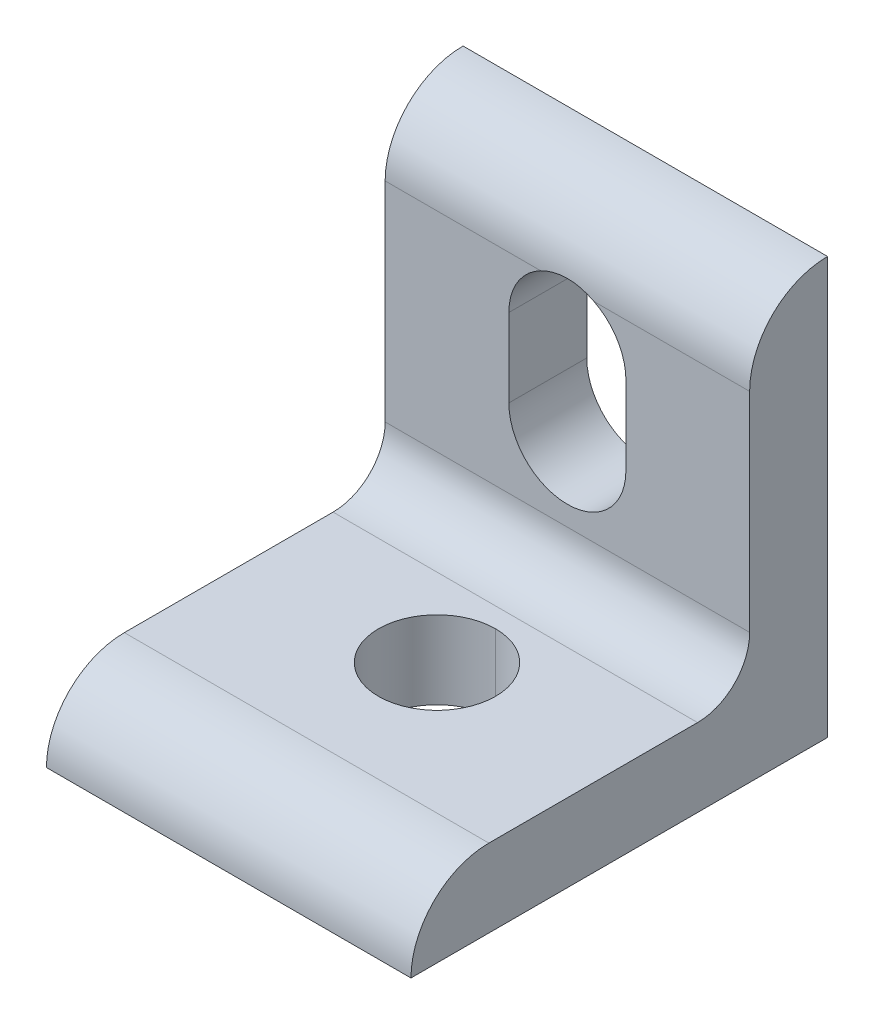
ISO-10303-21;
HEADER;
FILE_DESCRIPTION(('STEP AP214'),'2;1');
FILE_NAME('part.step','',(''),(''),'','','');
FILE_SCHEMA(('AUTOMOTIVE_DESIGN { 1 0 10303 214 1 1 1 1 }'));
ENDSEC;
DATA;
#1=APPLICATION_CONTEXT('core data for automotive mechanical design processes');
#2=APPLICATION_PROTOCOL_DEFINITION('international standard','automotive_design',2000,#1);
#3=PRODUCT_CONTEXT('',#1,'mechanical');
#4=PRODUCT('Part','Part','',(#3));
#5=PRODUCT_RELATED_PRODUCT_CATEGORY('part','',(#4));
#6=PRODUCT_DEFINITION_FORMATION('','',#4);
#7=PRODUCT_DEFINITION_CONTEXT('part definition',#1,'design');
#8=PRODUCT_DEFINITION('design','',#6,#7);
#9=PRODUCT_DEFINITION_SHAPE('','',#8);
#10=(LENGTH_UNIT() NAMED_UNIT(*) SI_UNIT(.MILLI.,.METRE.));
#11=(NAMED_UNIT(*) PLANE_ANGLE_UNIT() SI_UNIT($,.RADIAN.));
#12=(NAMED_UNIT(*) SI_UNIT($,.STERADIAN.) SOLID_ANGLE_UNIT());
#13=UNCERTAINTY_MEASURE_WITH_UNIT(LENGTH_MEASURE(1.E-05),#10,'distance_accuracy_value','');
#14=(GEOMETRIC_REPRESENTATION_CONTEXT(3) GLOBAL_UNCERTAINTY_ASSIGNED_CONTEXT((#13)) GLOBAL_UNIT_ASSIGNED_CONTEXT((#10,
#11,#12)) REPRESENTATION_CONTEXT('',''));
#15=CARTESIAN_POINT('',(0.,0.,0.));
#16=DIRECTION('',(0.,0.,1.));
#17=DIRECTION('',(1.,0.,0.));
#18=AXIS2_PLACEMENT_3D('',#15,#16,#17);
#19=CARTESIAN_POINT('',(11.1125,20.6502000000003,3.02492406123456E-13));
#20=DIRECTION('',(-1.,0.,0.));
#21=DIRECTION('',(0.,-0.707106781186548,-0.707106781186547));
#22=AXIS2_PLACEMENT_3D('',#19,#20,#21);
#23=CYLINDRICAL_SURFACE('',#22,4.7497999999997);
#24=CARTESIAN_POINT('',(1.62941544426215,20.6502,4.7498));
#25=CARTESIAN_POINT('',(1.58771081475754,20.6716034856698,4.74979974663532));
#26=CARTESIAN_POINT('',(1.54558425612767,20.6921841983574,4.74966851430968));
#27=CARTESIAN_POINT('',(1.46044579112191,20.7317204261948,4.74919246835393));
#28=CARTESIAN_POINT('',(1.41743190130384,20.7506716639528,4.74884711102949));
#29=CARTESIAN_POINT('',(1.33061351037316,20.7868920036165,4.74799093163444));
#30=CARTESIAN_POINT('',(1.2868077395313,20.8041580547705,4.74747981645891));
#31=CARTESIAN_POINT('',(1.19850462397125,20.836959486562,4.74633992900318));
#32=CARTESIAN_POINT('',(1.15400663129361,20.8524931187037,4.74571103954005));
#33=CARTESIAN_POINT('',(1.06442158531662,20.8817888826184,4.74438361323171));
#34=CARTESIAN_POINT('',(1.01933440572909,20.8955506275045,4.74368506123476));
#35=CARTESIAN_POINT('',(0.928676402628849,20.921270030396,4.74226626330771));
#36=CARTESIAN_POINT('',(0.88310586822046,20.9332287081759,4.74154602991876));
#37=CARTESIAN_POINT('',(0.79158880034789,20.955317768452,4.74013228917703));
#38=CARTESIAN_POINT('',(0.74564286030498,20.9654506073167,4.73943874691925));
#39=CARTESIAN_POINT('',(0.653484208680445,20.9838723251786,4.73812544793178));
#40=CARTESIAN_POINT('',(0.607272280405263,20.9921651116181,4.73750553617152));
#41=CARTESIAN_POINT('',(0.514657127790415,21.0069052008294,4.73639155213399));
#42=CARTESIAN_POINT('',(0.468254542769303,21.0133564996596,4.73589720763462));
#43=CARTESIAN_POINT('',(0.375134719315908,21.0244388838199,4.73506581396679));
#44=CARTESIAN_POINT('',(0.328417031160232,21.0290662151868,4.73472908893559));
#45=CARTESIAN_POINT('',(0.234732091815045,21.0364825419295,4.73420023725057));
#46=CARTESIAN_POINT('',(0.187764518046452,21.0392674850632,4.73400842920386));
#47=CARTESIAN_POINT('',(0.0936895393163037,21.0429809694374,4.73376591374451));
#48=CARTESIAN_POINT('',(0.0465820306009247,21.0439068954656,4.73371540506859));
#49=CARTESIAN_POINT('',(-0.0476619701041551,21.0438930228934,4.73374970108757));
#50=CARTESIAN_POINT('',(-0.0947984618903781,21.0429520630801,4.73383458999404));
#51=CARTESIAN_POINT('',(-0.188989199584484,21.0392039144651,4.73413443720798));
#52=CARTESIAN_POINT('',(-0.236043457466751,21.0363970248882,4.73434937466005));
#53=CARTESIAN_POINT('',(-0.329958802812705,21.0289253361312,4.73490414345233));
#54=CARTESIAN_POINT('',(-0.376820030649905,21.0242622924687,4.73524385675835));
#55=CARTESIAN_POINT('',(-0.470239410854945,21.0130953812573,4.73604213350947));
#56=CARTESIAN_POINT('',(-0.516797947184085,21.0065947108632,4.7365004904193));
#57=CARTESIAN_POINT('',(-0.609503693282872,20.991778287716,4.73753336092515));
#58=CARTESIAN_POINT('',(-0.655651643786121,20.9834671487465,4.73810757899211));
#59=CARTESIAN_POINT('',(-0.747555367397201,20.965038941085,4.73935864458339));
#60=CARTESIAN_POINT('',(-0.79331135871949,20.9549229563624,4.74003543047016));
#61=CARTESIAN_POINT('',(-0.884478989736967,20.9328755701145,4.74142650650754));
#62=CARTESIAN_POINT('',(-0.929889770496905,20.9209406213697,4.74214086811332));
#63=CARTESIAN_POINT('',(-1.02025908404943,20.8952731110481,4.74355894802427));
#64=CARTESIAN_POINT('',(-1.06521701367041,20.8815384250336,4.74426265263711));
#65=CARTESIAN_POINT('',(-1.15457409774702,20.8522977382991,4.74560627284927));
#66=CARTESIAN_POINT('',(-1.19897302047046,20.8367910282061,4.74624616270908));
#67=CARTESIAN_POINT('',(-1.28710795782765,20.8040409555758,4.74741022276381));
#68=CARTESIAN_POINT('',(-1.33084421903748,20.7867982582136,4.74793443703804));
#69=CARTESIAN_POINT('',(-1.41755271520107,20.7506187491641,4.74881487388939));
#70=CARTESIAN_POINT('',(-1.46052577580067,20.7316839212114,4.74917129018524));
#71=CARTESIAN_POINT('',(-1.54561058696088,20.6921713333414,4.74966352331008));
#72=CARTESIAN_POINT('',(-1.587723835021,20.6715968030771,4.749799763069));
#73=CARTESIAN_POINT('',(-1.62941544426215,20.6502,4.7498));
#74=B_SPLINE_CURVE_WITH_KNOTS('',3,(#24,#25,#26,#27,#28,#29,#30,#31,#32,#33,#34,#35,#36,#37,#38,
#39,#40,#41,#42,#43,#44,#45,#46,#47,#48,#49,#50,#51,#52,#53,#54,#55,#56,#57,#58,#59,#60,#61,#62,
#63,#64,#65,#66,#67,#68,#69,#70,#71,#72,#73),.UNSPECIFIED.,.F.,.F.,(4,2,2,2,2,2,2,2,2,2,2,2,2,2,
2,2,2,2,2,2,2,2,2,2,4),(0.,0.14061914710553,0.281596817120043,0.422825145757393,
0.564194747466604,0.705595164691953,0.846915306564413,0.988043882152591,1.12886983337309,
1.26938782549957,1.41019353053859,1.55130791016504,1.69262066678115,1.83402134823024,
1.97539935979175,2.1166439750222,2.25764434557146,2.39828951008736,2.53885048737469,
2.679689169978,2.82069562410568,2.96175872470757,3.10276797866123,3.2436140391769,
3.38418923013091),.UNSPECIFIED.);
#75=CARTESIAN_POINT('',(1.62941544426215,20.6502,4.7498));
#76=VERTEX_POINT('',#75);
#77=CARTESIAN_POINT('',(-1.62941544426215,20.6502,4.7498));
#78=VERTEX_POINT('',#77);
#79=EDGE_CURVE('E11',#76,#78,#74,.T.);
#80=ORIENTED_EDGE('',*,*,#79,.F.);
#81=DIRECTION('',(-1.,0.,0.));
#82=VECTOR('',#81,1.);
#83=CARTESIAN_POINT('',(11.1125,20.6502,4.7498));
#84=LINE('',#83,#82);
#85=CARTESIAN_POINT('',(11.1125,20.6502,4.7498));
#86=VERTEX_POINT('',#85);
#87=EDGE_CURVE('E25',#86,#76,#84,.T.);
#88=ORIENTED_EDGE('',*,*,#87,.F.);
#89=CARTESIAN_POINT('',(11.1125,20.6502000000003,3.02492406123456E-13));
#90=DIRECTION('',(1.,0.,0.));
#91=DIRECTION('',(0.,0.,-1.));
#92=AXIS2_PLACEMENT_3D('',#89,#90,#91);
#93=CIRCLE('',#92,4.7497999999997);
#94=CARTESIAN_POINT('',(11.1125,25.4,0.));
#95=VERTEX_POINT('',#94);
#96=EDGE_CURVE('E226',#95,#86,#93,.T.);
#97=ORIENTED_EDGE('',*,*,#96,.F.);
#98=DIRECTION('',(-1.,0.,0.));
#99=VECTOR('',#98,1.);
#100=CARTESIAN_POINT('',(11.1125,25.4,0.));
#101=LINE('',#100,#99);
#102=CARTESIAN_POINT('',(-11.1125,25.4,0.));
#103=VERTEX_POINT('',#102);
#104=EDGE_CURVE('E222',#95,#103,#101,.T.);
#105=ORIENTED_EDGE('',*,*,#104,.T.);
#106=CARTESIAN_POINT('',(-11.1125,20.6502000000003,3.02492406123456E-13));
#107=DIRECTION('',(1.,0.,0.));
#108=DIRECTION('',(0.,0.,-1.));
#109=AXIS2_PLACEMENT_3D('',#106,#107,#108);
#110=CIRCLE('',#109,4.7497999999997);
#111=CARTESIAN_POINT('',(-11.1125,20.6502,4.7498));
#112=VERTEX_POINT('',#111);
#113=EDGE_CURVE('E218',#103,#112,#110,.T.);
#114=ORIENTED_EDGE('',*,*,#113,.T.);
#115=DIRECTION('',(-1.,0.,0.));
#116=VECTOR('',#115,1.);
#117=CARTESIAN_POINT('',(11.1125,20.6502,4.7498));
#118=LINE('',#117,#116);
#119=EDGE_CURVE('E200',#78,#112,#118,.T.);
#120=ORIENTED_EDGE('',*,*,#119,.F.);
#121=EDGE_LOOP('',(#80,#88,#97,#105,#114,#120));
#122=FACE_BOUND('',#121,.T.);
#123=ADVANCED_FACE('F16',(#122),#23,.T.);
#124=CARTESIAN_POINT('',(11.1125,20.6502,4.7498));
#125=DIRECTION('',(0.,0.,-1.));
#126=DIRECTION('',(-1.,0.,0.));
#127=AXIS2_PLACEMENT_3D('',#124,#125,#126);
#128=PLANE('',#127);
#129=CARTESIAN_POINT('',(0.,17.4752,4.7498));
#130=DIRECTION('',(0.,0.,1.));
#131=DIRECTION('',(-1.,0.,0.));
#132=AXIS2_PLACEMENT_3D('',#129,#130,#131);
#133=CIRCLE('',#132,3.5687);
#134=CARTESIAN_POINT('',(3.5687,17.4752,4.7498));
#135=VERTEX_POINT('',#134);
#136=EDGE_CURVE('E196',#135,#76,#133,.T.);
#137=ORIENTED_EDGE('',*,*,#136,.F.);
#138=DIRECTION('',(0.,1.,0.));
#139=VECTOR('',#138,1.);
#140=CARTESIAN_POINT('',(3.5687,20.6502,4.7498));
#141=LINE('',#140,#139);
#142=CARTESIAN_POINT('',(3.5687,12.7,4.7498));
#143=VERTEX_POINT('',#142);
#144=EDGE_CURVE('E198',#143,#135,#141,.T.);
#145=ORIENTED_EDGE('',*,*,#144,.F.);
#146=CARTESIAN_POINT('',(0.,12.7,4.7498));
#147=DIRECTION('',(0.,0.,1.));
#148=DIRECTION('',(-1.,0.,0.));
#149=AXIS2_PLACEMENT_3D('',#146,#147,#148);
#150=CIRCLE('',#149,3.5687);
#151=CARTESIAN_POINT('',(-3.5687,12.7,4.7498));
#152=VERTEX_POINT('',#151);
#153=EDGE_CURVE('E205',#152,#143,#150,.T.);
#154=ORIENTED_EDGE('',*,*,#153,.F.);
#155=DIRECTION('',(0.,-1.,0.));
#156=VECTOR('',#155,1.);
#157=CARTESIAN_POINT('',(-3.5687,20.6502,4.7498));
#158=LINE('',#157,#156);
#159=CARTESIAN_POINT('',(-3.5687,17.4752,4.7498));
#160=VERTEX_POINT('',#159);
#161=EDGE_CURVE('E207',#160,#152,#158,.T.);
#162=ORIENTED_EDGE('',*,*,#161,.F.);
#163=CARTESIAN_POINT('',(0.,17.4752,4.7498));
#164=DIRECTION('',(0.,0.,1.));
#165=DIRECTION('',(-1.,0.,0.));
#166=AXIS2_PLACEMENT_3D('',#163,#164,#165);
#167=CIRCLE('',#166,3.5687);
#168=EDGE_CURVE('E139',#78,#160,#167,.T.);
#169=ORIENTED_EDGE('',*,*,#168,.F.);
#170=ORIENTED_EDGE('',*,*,#119,.T.);
#171=DIRECTION('',(0.,-1.,0.));
#172=VECTOR('',#171,1.);
#173=CARTESIAN_POINT('',(-11.1125,20.6502,4.7498));
#174=LINE('',#173,#172);
#175=CARTESIAN_POINT('',(-11.1125,7.9248,4.7498));
#176=VERTEX_POINT('',#175);
#177=EDGE_CURVE('E261',#112,#176,#174,.T.);
#178=ORIENTED_EDGE('',*,*,#177,.T.);
#179=DIRECTION('',(-1.,0.,0.));
#180=VECTOR('',#179,1.);
#181=CARTESIAN_POINT('',(11.1125,7.9248,4.7498));
#182=LINE('',#181,#180);
#183=CARTESIAN_POINT('',(11.1125,7.9248,4.7498));
#184=VERTEX_POINT('',#183);
#185=EDGE_CURVE('E264',#184,#176,#182,.T.);
#186=ORIENTED_EDGE('',*,*,#185,.F.);
#187=DIRECTION('',(0.,-1.,0.));
#188=VECTOR('',#187,1.);
#189=CARTESIAN_POINT('',(11.1125,20.6502,4.7498));
#190=LINE('',#189,#188);
#191=EDGE_CURVE('E244',#86,#184,#190,.T.);
#192=ORIENTED_EDGE('',*,*,#191,.F.);
#193=ORIENTED_EDGE('',*,*,#87,.T.);
#194=EDGE_LOOP('',(#137,#145,#154,#162,#169,#170,#178,#186,#192,#193));
#195=FACE_BOUND('',#194,.T.);
#196=ADVANCED_FACE('F188',(#195),#128,.F.);
#197=CARTESIAN_POINT('',(11.1125,3.02709246557953E-13,20.6502000000003));
#198=DIRECTION('',(1.,0.,0.));
#199=DIRECTION('',(0.,0.,-1.));
#200=AXIS2_PLACEMENT_3D('',#197,#198,#199);
#201=PLANE('',#200);
#202=CARTESIAN_POINT('',(11.1125,3.02709246557953E-13,20.6502000000003));
#203=DIRECTION('',(1.,0.,0.));
#204=DIRECTION('',(0.,0.,-1.));
#205=AXIS2_PLACEMENT_3D('',#202,#203,#204);
#206=CIRCLE('',#205,4.7497999999997);
#207=CARTESIAN_POINT('',(11.1125,4.7498,20.6502));
#208=VERTEX_POINT('',#207);
#209=CARTESIAN_POINT('',(11.1125,0.,25.4));
#210=VERTEX_POINT('',#209);
#211=EDGE_CURVE('E280',#208,#210,#206,.T.);
#212=ORIENTED_EDGE('',*,*,#211,.T.);
#213=DIRECTION('',(0.,0.,-1.));
#214=VECTOR('',#213,1.);
#215=CARTESIAN_POINT('',(11.1125,0.,25.4));
#216=LINE('',#215,#214);
#217=CARTESIAN_POINT('',(11.1125,0.,0.));
#218=VERTEX_POINT('',#217);
#219=EDGE_CURVE('E284',#210,#218,#216,.T.);
#220=ORIENTED_EDGE('',*,*,#219,.T.);
#221=DIRECTION('',(0.,1.,0.));
#222=VECTOR('',#221,1.);
#223=CARTESIAN_POINT('',(11.1125,0.,0.));
#224=LINE('',#223,#222);
#225=EDGE_CURVE('E246',#218,#95,#224,.T.);
#226=ORIENTED_EDGE('',*,*,#225,.T.);
#227=ORIENTED_EDGE('',*,*,#96,.T.);
#228=ORIENTED_EDGE('',*,*,#191,.T.);
#229=CARTESIAN_POINT('',(11.1125,7.9248,7.9248));
#230=DIRECTION('',(1.,0.,0.));
#231=DIRECTION('',(0.,0.,-1.));
#232=AXIS2_PLACEMENT_3D('',#229,#230,#231);
#233=CIRCLE('',#232,3.17499999999997);
#234=CARTESIAN_POINT('',(11.1125,4.7498,7.9248));
#235=VERTEX_POINT('',#234);
#236=EDGE_CURVE('E291',#235,#184,#233,.T.);
#237=ORIENTED_EDGE('',*,*,#236,.F.);
#238=DIRECTION('',(0.,0.,1.));
#239=VECTOR('',#238,1.);
#240=CARTESIAN_POINT('',(11.1125,4.7498,7.9248));
#241=LINE('',#240,#239);
#242=EDGE_CURVE('E296',#235,#208,#241,.T.);
#243=ORIENTED_EDGE('',*,*,#242,.T.);
#244=EDGE_LOOP('',(#212,#220,#226,#227,#228,#237,#243));
#245=FACE_BOUND('',#244,.T.);
#246=ADVANCED_FACE('F185',(#245),#201,.T.);
#247=CARTESIAN_POINT('',(11.1125,4.7498,7.9248));
#248=DIRECTION('',(0.,-1.,0.));
#249=DIRECTION('',(0.,0.,-1.));
#250=AXIS2_PLACEMENT_3D('',#247,#248,#249);
#251=PLANE('',#250);
#252=CARTESIAN_POINT('',(0.,4.7498,12.7));
#253=DIRECTION('',(0.,1.,0.));
#254=DIRECTION('',(0.,0.,-1.));
#255=AXIS2_PLACEMENT_3D('',#252,#253,#254);
#256=CIRCLE('',#255,3.5687);
#257=CARTESIAN_POINT('',(0.,4.7498,16.2687));
#258=VERTEX_POINT('',#257);
#259=CARTESIAN_POINT('',(0.,4.7498,9.1313));
#260=VERTEX_POINT('',#259);
#261=EDGE_CURVE('E300',#258,#260,#256,.T.);
#262=ORIENTED_EDGE('',*,*,#261,.F.);
#263=CARTESIAN_POINT('',(0.,4.7498,12.7));
#264=DIRECTION('',(0.,1.,0.));
#265=DIRECTION('',(0.,0.,-1.));
#266=AXIS2_PLACEMENT_3D('',#263,#264,#265);
#267=CIRCLE('',#266,3.5687);
#268=EDGE_CURVE('E305',#260,#258,#267,.T.);
#269=ORIENTED_EDGE('',*,*,#268,.F.);
#270=EDGE_LOOP('',(#262,#269));
#271=FACE_BOUND('',#270,.T.);
#272=DIRECTION('',(0.,0.,1.));
#273=VECTOR('',#272,1.);
#274=CARTESIAN_POINT('',(-11.1125,4.7498,7.9248));
#275=LINE('',#274,#273);
#276=CARTESIAN_POINT('',(-11.1125,4.7498,7.9248));
#277=VERTEX_POINT('',#276);
#278=CARTESIAN_POINT('',(-11.1125,4.7498,20.6502));
#279=VERTEX_POINT('',#278);
#280=EDGE_CURVE('E310',#277,#279,#275,.T.);
#281=ORIENTED_EDGE('',*,*,#280,.T.);
#282=DIRECTION('',(-1.,0.,0.));
#283=VECTOR('',#282,1.);
#284=CARTESIAN_POINT('',(11.1125,4.7498,20.6502));
#285=LINE('',#284,#283);
#286=EDGE_CURVE('E314',#208,#279,#285,.T.);
#287=ORIENTED_EDGE('',*,*,#286,.F.);
#288=ORIENTED_EDGE('',*,*,#242,.F.);
#289=DIRECTION('',(-1.,0.,0.));
#290=VECTOR('',#289,1.);
#291=CARTESIAN_POINT('',(11.1125,4.7498,7.9248));
#292=LINE('',#291,#290);
#293=EDGE_CURVE('E319',#235,#277,#292,.T.);
#294=ORIENTED_EDGE('',*,*,#293,.T.);
#295=EDGE_LOOP('',(#281,#287,#288,#294));
#296=FACE_BOUND('',#295,.T.);
#297=ADVANCED_FACE('F181',(#271,#296),#251,.F.);
#298=CARTESIAN_POINT('',(11.1125,7.9248,7.9248));
#299=DIRECTION('',(-1.,0.,0.));
#300=DIRECTION('',(0.,0.707106781186548,0.707106781186547));
#301=AXIS2_PLACEMENT_3D('',#298,#299,#300);
#302=CYLINDRICAL_SURFACE('',#301,3.17499999999997);
#303=CARTESIAN_POINT('',(-11.1125,7.9248,7.9248));
#304=DIRECTION('',(1.,0.,0.));
#305=DIRECTION('',(0.,0.,-1.));
#306=AXIS2_PLACEMENT_3D('',#303,#304,#305);
#307=CIRCLE('',#306,3.17499999999997);
#308=EDGE_CURVE('E323',#277,#176,#307,.T.);
#309=ORIENTED_EDGE('',*,*,#308,.F.);
#310=ORIENTED_EDGE('',*,*,#293,.F.);
#311=ORIENTED_EDGE('',*,*,#236,.T.);
#312=ORIENTED_EDGE('',*,*,#185,.T.);
#313=EDGE_LOOP('',(#309,#310,#311,#312));
#314=FACE_BOUND('',#313,.T.);
#315=ADVANCED_FACE('F177',(#314),#302,.F.);
#316=CARTESIAN_POINT('',(-11.1125,3.02709246557953E-13,20.6502000000003));
#317=DIRECTION('',(1.,0.,0.));
#318=DIRECTION('',(0.,0.,-1.));
#319=AXIS2_PLACEMENT_3D('',#316,#317,#318);
#320=PLANE('',#319);
#321=CARTESIAN_POINT('',(-11.1125,3.02709246557953E-13,20.6502000000003));
#322=DIRECTION('',(1.,0.,0.));
#323=DIRECTION('',(0.,0.,-1.));
#324=AXIS2_PLACEMENT_3D('',#321,#322,#323);
#325=CIRCLE('',#324,4.7497999999997);
#326=CARTESIAN_POINT('',(-11.1125,0.,25.4));
#327=VERTEX_POINT('',#326);
#328=EDGE_CURVE('E255',#279,#327,#325,.T.);
#329=ORIENTED_EDGE('',*,*,#328,.F.);
#330=ORIENTED_EDGE('',*,*,#280,.F.);
#331=ORIENTED_EDGE('',*,*,#308,.T.);
#332=ORIENTED_EDGE('',*,*,#177,.F.);
#333=ORIENTED_EDGE('',*,*,#113,.F.);
#334=DIRECTION('',(0.,1.,0.));
#335=VECTOR('',#334,1.);
#336=CARTESIAN_POINT('',(-11.1125,0.,0.));
#337=LINE('',#336,#335);
#338=CARTESIAN_POINT('',(-11.1125,0.,0.));
#339=VERTEX_POINT('',#338);
#340=EDGE_CURVE('E250',#339,#103,#337,.T.);
#341=ORIENTED_EDGE('',*,*,#340,.F.);
#342=DIRECTION('',(0.,0.,-1.));
#343=VECTOR('',#342,1.);
#344=CARTESIAN_POINT('',(-11.1125,0.,25.4));
#345=LINE('',#344,#343);
#346=EDGE_CURVE('E256',#327,#339,#345,.T.);
#347=ORIENTED_EDGE('',*,*,#346,.F.);
#348=EDGE_LOOP('',(#329,#330,#331,#332,#333,#341,#347));
#349=FACE_BOUND('',#348,.T.);
#350=ADVANCED_FACE('F173',(#349),#320,.F.);
#351=CARTESIAN_POINT('',(11.1125,0.,25.4));
#352=DIRECTION('',(0.,1.,0.));
#353=DIRECTION('',(0.,0.,1.));
#354=AXIS2_PLACEMENT_3D('',#351,#352,#353);
#355=PLANE('',#354);
#356=CARTESIAN_POINT('',(0.,0.,12.7));
#357=DIRECTION('',(0.,1.,0.));
#358=DIRECTION('',(1.,0.,0.));
#359=AXIS2_PLACEMENT_3D('',#356,#357,#358);
#360=CIRCLE('',#359,3.5687);
#361=CARTESIAN_POINT('',(0.,0.,9.1313));
#362=VERTEX_POINT('',#361);
#363=CARTESIAN_POINT('',(0.,0.,16.2687));
#364=VERTEX_POINT('',#363);
#365=EDGE_CURVE('E336',#362,#364,#360,.T.);
#366=ORIENTED_EDGE('',*,*,#365,.T.);
#367=CARTESIAN_POINT('',(0.,0.,12.7));
#368=DIRECTION('',(0.,1.,0.));
#369=DIRECTION('',(0.,0.,1.));
#370=AXIS2_PLACEMENT_3D('',#367,#368,#369);
#371=CIRCLE('',#370,3.5687);
#372=EDGE_CURVE('E340',#364,#362,#371,.T.);
#373=ORIENTED_EDGE('',*,*,#372,.T.);
#374=EDGE_LOOP('',(#366,#373));
#375=FACE_BOUND('',#374,.T.);
#376=ORIENTED_EDGE('',*,*,#346,.T.);
#377=DIRECTION('',(-1.,0.,0.));
#378=VECTOR('',#377,1.);
#379=CARTESIAN_POINT('',(11.1125,0.,0.));
#380=LINE('',#379,#378);
#381=EDGE_CURVE('E253',#218,#339,#380,.T.);
#382=ORIENTED_EDGE('',*,*,#381,.F.);
#383=ORIENTED_EDGE('',*,*,#219,.F.);
#384=DIRECTION('',(-1.,0.,0.));
#385=VECTOR('',#384,1.);
#386=CARTESIAN_POINT('',(11.1125,0.,25.4));
#387=LINE('',#386,#385);
#388=EDGE_CURVE('E134',#210,#327,#387,.T.);
#389=ORIENTED_EDGE('',*,*,#388,.T.);
#390=EDGE_LOOP('',(#376,#382,#383,#389));
#391=FACE_BOUND('',#390,.T.);
#392=ADVANCED_FACE('F169',(#375,#391),#355,.F.);
#393=CARTESIAN_POINT('',(11.1125,3.02709246557953E-13,20.6502000000003));
#394=DIRECTION('',(-1.,0.,0.));
#395=DIRECTION('',(0.,-0.707106781186547,-0.707106781186548));
#396=AXIS2_PLACEMENT_3D('',#393,#394,#395);
#397=CYLINDRICAL_SURFACE('',#396,4.7497999999997);
#398=ORIENTED_EDGE('',*,*,#328,.T.);
#399=ORIENTED_EDGE('',*,*,#388,.F.);
#400=ORIENTED_EDGE('',*,*,#211,.F.);
#401=ORIENTED_EDGE('',*,*,#286,.T.);
#402=EDGE_LOOP('',(#398,#399,#400,#401));
#403=FACE_BOUND('',#402,.T.);
#404=ADVANCED_FACE('F166',(#403),#397,.T.);
#405=CARTESIAN_POINT('',(11.1125,0.,0.));
#406=DIRECTION('',(0.,0.,1.));
#407=DIRECTION('',(1.,0.,0.));
#408=AXIS2_PLACEMENT_3D('',#405,#406,#407);
#409=PLANE('',#408);
#410=DIRECTION('',(0.,-1.,0.));
#411=VECTOR('',#410,1.);
#412=CARTESIAN_POINT('',(-3.5687,17.4752,0.));
#413=LINE('',#412,#411);
#414=CARTESIAN_POINT('',(-3.5687,17.4752,0.));
#415=VERTEX_POINT('',#414);
#416=CARTESIAN_POINT('',(-3.5687,12.7,0.));
#417=VERTEX_POINT('',#416);
#418=EDGE_CURVE('E116',#415,#417,#413,.T.);
#419=ORIENTED_EDGE('',*,*,#418,.T.);
#420=CARTESIAN_POINT('',(0.,12.7,0.));
#421=DIRECTION('',(0.,0.,1.));
#422=DIRECTION('',(1.,0.,0.));
#423=AXIS2_PLACEMENT_3D('',#420,#421,#422);
#424=CIRCLE('',#423,3.5687);
#425=CARTESIAN_POINT('',(3.5687,12.7,0.));
#426=VERTEX_POINT('',#425);
#427=EDGE_CURVE('E135',#417,#426,#424,.T.);
#428=ORIENTED_EDGE('',*,*,#427,.T.);
#429=DIRECTION('',(0.,1.,0.));
#430=VECTOR('',#429,1.);
#431=CARTESIAN_POINT('',(3.5687,12.7,0.));
#432=LINE('',#431,#430);
#433=CARTESIAN_POINT('',(3.5687,17.4752,0.));
#434=VERTEX_POINT('',#433);
#435=EDGE_CURVE('E119',#426,#434,#432,.T.);
#436=ORIENTED_EDGE('',*,*,#435,.T.);
#437=CARTESIAN_POINT('',(0.,17.4752,0.));
#438=DIRECTION('',(0.,0.,1.));
#439=DIRECTION('',(1.,0.,0.));
#440=AXIS2_PLACEMENT_3D('',#437,#438,#439);
#441=CIRCLE('',#440,3.5687);
#442=EDGE_CURVE('E112',#434,#415,#441,.T.);
#443=ORIENTED_EDGE('',*,*,#442,.T.);
#444=EDGE_LOOP('',(#419,#428,#436,#443));
#445=FACE_BOUND('',#444,.T.);
#446=ORIENTED_EDGE('',*,*,#340,.T.);
#447=ORIENTED_EDGE('',*,*,#104,.F.);
#448=ORIENTED_EDGE('',*,*,#225,.F.);
#449=ORIENTED_EDGE('',*,*,#381,.T.);
#450=EDGE_LOOP('',(#446,#447,#448,#449));
#451=FACE_BOUND('',#450,.T.);
#452=ADVANCED_FACE('F114',(#445,#451),#409,.F.);
#453=CARTESIAN_POINT('',(0.,17.4752,7.1247));
#454=DIRECTION('',(0.,0.,-1.));
#455=DIRECTION('',(0.,-1.,0.));
#456=AXIS2_PLACEMENT_3D('',#453,#454,#455);
#457=CYLINDRICAL_SURFACE('',#456,3.5687);
#458=ORIENTED_EDGE('',*,*,#136,.T.);
#459=ORIENTED_EDGE('',*,*,#79,.T.);
#460=ORIENTED_EDGE('',*,*,#168,.T.);
#461=DIRECTION('',(0.,0.,-1.));
#462=VECTOR('',#461,1.);
#463=CARTESIAN_POINT('',(-3.5687,17.4752,7.1247));
#464=LINE('',#463,#462);
#465=EDGE_CURVE('E124',#160,#415,#464,.T.);
#466=ORIENTED_EDGE('',*,*,#465,.T.);
#467=ORIENTED_EDGE('',*,*,#442,.F.);
#468=DIRECTION('',(0.,0.,-1.));
#469=VECTOR('',#468,1.);
#470=CARTESIAN_POINT('',(3.5687,17.4752,7.1247));
#471=LINE('',#470,#469);
#472=EDGE_CURVE('E140',#135,#434,#471,.T.);
#473=ORIENTED_EDGE('',*,*,#472,.F.);
#474=EDGE_LOOP('',(#458,#459,#460,#466,#467,#473));
#475=FACE_BOUND('',#474,.T.);
#476=ADVANCED_FACE('F137',(#475),#457,.F.);
#477=CARTESIAN_POINT('',(3.5687,12.7,7.1247));
#478=DIRECTION('',(-1.,0.,0.));
#479=DIRECTION('',(0.,0.,1.));
#480=AXIS2_PLACEMENT_3D('',#477,#478,#479);
#481=PLANE('',#480);
#482=ORIENTED_EDGE('',*,*,#144,.T.);
#483=ORIENTED_EDGE('',*,*,#472,.T.);
#484=ORIENTED_EDGE('',*,*,#435,.F.);
#485=DIRECTION('',(0.,0.,-1.));
#486=VECTOR('',#485,1.);
#487=CARTESIAN_POINT('',(3.5687,12.7,7.1247));
#488=LINE('',#487,#486);
#489=EDGE_CURVE('E142',#143,#426,#488,.T.);
#490=ORIENTED_EDGE('',*,*,#489,.F.);
#491=EDGE_LOOP('',(#482,#483,#484,#490));
#492=FACE_BOUND('',#491,.T.);
#493=ADVANCED_FACE('F162',(#492),#481,.T.);
#494=CARTESIAN_POINT('',(0.,12.7,7.1247));
#495=DIRECTION('',(0.,0.,-1.));
#496=DIRECTION('',(0.,1.,0.));
#497=AXIS2_PLACEMENT_3D('',#494,#495,#496);
#498=CYLINDRICAL_SURFACE('',#497,3.5687);
#499=ORIENTED_EDGE('',*,*,#153,.T.);
#500=ORIENTED_EDGE('',*,*,#489,.T.);
#501=ORIENTED_EDGE('',*,*,#427,.F.);
#502=DIRECTION('',(0.,0.,-1.));
#503=VECTOR('',#502,1.);
#504=CARTESIAN_POINT('',(-3.5687,12.7,7.1247));
#505=LINE('',#504,#503);
#506=EDGE_CURVE('E132',#152,#417,#505,.T.);
#507=ORIENTED_EDGE('',*,*,#506,.F.);
#508=EDGE_LOOP('',(#499,#500,#501,#507));
#509=FACE_BOUND('',#508,.T.);
#510=ADVANCED_FACE('F361',(#509),#498,.F.);
#511=CARTESIAN_POINT('',(-3.5687,17.4752,7.1247));
#512=DIRECTION('',(1.,0.,0.));
#513=DIRECTION('',(0.,0.,-1.));
#514=AXIS2_PLACEMENT_3D('',#511,#512,#513);
#515=PLANE('',#514);
#516=ORIENTED_EDGE('',*,*,#161,.T.);
#517=ORIENTED_EDGE('',*,*,#506,.T.);
#518=ORIENTED_EDGE('',*,*,#418,.F.);
#519=ORIENTED_EDGE('',*,*,#465,.F.);
#520=EDGE_LOOP('',(#516,#517,#518,#519));
#521=FACE_BOUND('',#520,.T.);
#522=ADVANCED_FACE('F129',(#521),#515,.T.);
#523=CARTESIAN_POINT('',(0.,10.4648,12.7));
#524=DIRECTION('',(0.,-1.,0.));
#525=DIRECTION('',(-1.,0.,0.));
#526=AXIS2_PLACEMENT_3D('',#523,#524,#525);
#527=CYLINDRICAL_SURFACE('',#526,3.5687);
#528=DIRECTION('',(0.,-1.,0.));
#529=VECTOR('',#528,1.);
#530=CARTESIAN_POINT('',(0.,4.7498,16.2687));
#531=LINE('',#530,#529);
#532=EDGE_CURVE('E363',#258,#364,#531,.T.);
#533=ORIENTED_EDGE('',*,*,#532,.F.);
#534=ORIENTED_EDGE('',*,*,#261,.T.);
#535=DIRECTION('',(0.,-1.,0.));
#536=VECTOR('',#535,1.);
#537=CARTESIAN_POINT('',(0.,4.7498,9.1313));
#538=LINE('',#537,#536);
#539=EDGE_CURVE('E374',#260,#362,#538,.T.);
#540=ORIENTED_EDGE('',*,*,#539,.T.);
#541=ORIENTED_EDGE('',*,*,#372,.F.);
#542=EDGE_LOOP('',(#533,#534,#540,#541));
#543=FACE_BOUND('',#542,.T.);
#544=ADVANCED_FACE('F382',(#543),#527,.F.);
#545=CARTESIAN_POINT('',(0.,10.4648,12.7));
#546=DIRECTION('',(0.,-1.,0.));
#547=DIRECTION('',(1.,0.,0.));
#548=AXIS2_PLACEMENT_3D('',#545,#546,#547);
#549=CYLINDRICAL_SURFACE('',#548,3.5687);
#550=ORIENTED_EDGE('',*,*,#532,.T.);
#551=ORIENTED_EDGE('',*,*,#365,.F.);
#552=ORIENTED_EDGE('',*,*,#539,.F.);
#553=ORIENTED_EDGE('',*,*,#268,.T.);
#554=EDGE_LOOP('',(#550,#551,#552,#553));
#555=FACE_BOUND('',#554,.T.);
#556=ADVANCED_FACE('F385',(#555),#549,.F.);
#557=CLOSED_SHELL('',(#123,#196,#246,#297,#315,#350,#392,#404,#452,#476,#493,#510,#522,#544,#556));
#558=MANIFOLD_SOLID_BREP('B1',#557);
#559=ADVANCED_BREP_SHAPE_REPRESENTATION('',(#18,#558),#14);
#560=SHAPE_DEFINITION_REPRESENTATION(#9,#559);
ENDSEC;
END-ISO-10303-21;
